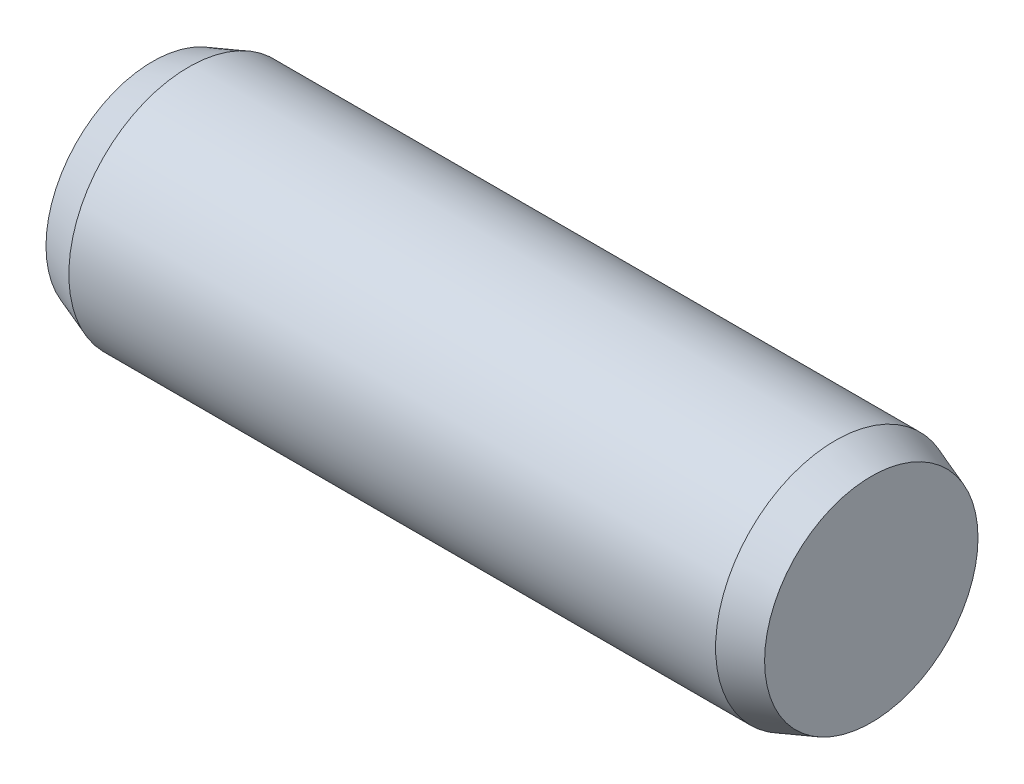
ISO-10303-21;
HEADER;
FILE_DESCRIPTION(('STEP AP214'),'2;1');
FILE_NAME('part.step','',(''),(''),'','','');
FILE_SCHEMA(('AUTOMOTIVE_DESIGN { 1 0 10303 214 1 1 1 1 }'));
ENDSEC;
DATA;
#1=APPLICATION_CONTEXT('core data for automotive mechanical design processes');
#2=APPLICATION_PROTOCOL_DEFINITION('international standard','automotive_design',2000,#1);
#3=PRODUCT_CONTEXT('',#1,'mechanical');
#4=PRODUCT('Part','Part','',(#3));
#5=PRODUCT_RELATED_PRODUCT_CATEGORY('part','',(#4));
#6=PRODUCT_DEFINITION_FORMATION('','',#4);
#7=PRODUCT_DEFINITION_CONTEXT('part definition',#1,'design');
#8=PRODUCT_DEFINITION('design','',#6,#7);
#9=PRODUCT_DEFINITION_SHAPE('','',#8);
#10=(LENGTH_UNIT() NAMED_UNIT(*) SI_UNIT(.MILLI.,.METRE.));
#11=(NAMED_UNIT(*) PLANE_ANGLE_UNIT() SI_UNIT($,.RADIAN.));
#12=(NAMED_UNIT(*) SI_UNIT($,.STERADIAN.) SOLID_ANGLE_UNIT());
#13=UNCERTAINTY_MEASURE_WITH_UNIT(LENGTH_MEASURE(1.E-05),#10,'distance_accuracy_value','');
#14=(GEOMETRIC_REPRESENTATION_CONTEXT(3) GLOBAL_UNCERTAINTY_ASSIGNED_CONTEXT((#13)) GLOBAL_UNIT_ASSIGNED_CONTEXT((#10,
#11,#12)) REPRESENTATION_CONTEXT('',''));
#15=CARTESIAN_POINT('',(0.,0.,0.));
#16=DIRECTION('',(0.,0.,1.));
#17=DIRECTION('',(1.,0.,0.));
#18=AXIS2_PLACEMENT_3D('',#15,#16,#17);
#19=CARTESIAN_POINT('',(-2.7,0.,0.));
#20=DIRECTION('',(1.,0.,0.));
#21=DIRECTION('',(0.,0.,-1.));
#22=AXIS2_PLACEMENT_3D('',#19,#20,#21);
#23=CONICAL_SURFACE('',#22,1.00009999999269,0.349065850338585);
#24=CARTESIAN_POINT('',(-3.,0.,0.));
#25=DIRECTION('',(1.,0.,0.));
#26=DIRECTION('',(0.,0.,-1.));
#27=AXIS2_PLACEMENT_3D('',#24,#25,#26);
#28=CIRCLE('',#27,0.890908929733314);
#29=CARTESIAN_POINT('',(-3.,0.,-0.890908929733314));
#30=VERTEX_POINT('',#29);
#31=EDGE_CURVE('E10',#30,#30,#28,.T.);
#32=ORIENTED_EDGE('',*,*,#31,.T.);
#33=EDGE_LOOP('',(#32));
#34=FACE_BOUND('',#33,.T.);
#35=CARTESIAN_POINT('',(-2.7,0.,0.));
#36=DIRECTION('',(1.,0.,0.));
#37=DIRECTION('',(0.,0.,-1.));
#38=AXIS2_PLACEMENT_3D('',#35,#36,#37);
#39=CIRCLE('',#38,1.00009999999269);
#40=CARTESIAN_POINT('',(-2.7,0.,-1.00009999999269));
#41=VERTEX_POINT('',#40);
#42=EDGE_CURVE('E45',#41,#41,#39,.T.);
#43=ORIENTED_EDGE('',*,*,#42,.F.);
#44=EDGE_LOOP('',(#43));
#45=FACE_BOUND('',#44,.T.);
#46=ADVANCED_FACE('F31',(#34,#45),#23,.T.);
#47=CARTESIAN_POINT('',(-3.,0.890908929733314,0.));
#48=DIRECTION('',(-1.,0.,0.));
#49=DIRECTION('',(0.,0.,1.));
#50=AXIS2_PLACEMENT_3D('',#47,#48,#49);
#51=PLANE('',#50);
#52=ORIENTED_EDGE('',*,*,#31,.F.);
#53=EDGE_LOOP('',(#52));
#54=FACE_BOUND('',#53,.T.);
#55=ADVANCED_FACE('F55',(#54),#51,.T.);
#56=CARTESIAN_POINT('',(3.,0.,0.));
#57=DIRECTION('',(1.,0.,0.));
#58=DIRECTION('',(0.,0.,-1.));
#59=AXIS2_PLACEMENT_3D('',#56,#57,#58);
#60=PLANE('',#59);
#61=CARTESIAN_POINT('',(3.,0.,0.));
#62=DIRECTION('',(1.,0.,0.));
#63=DIRECTION('',(0.,0.,-1.));
#64=AXIS2_PLACEMENT_3D('',#61,#62,#63);
#65=CIRCLE('',#64,0.890908929710118);
#66=CARTESIAN_POINT('',(3.,0.,-0.890908929710118));
#67=VERTEX_POINT('',#66);
#68=EDGE_CURVE('E37',#67,#67,#65,.T.);
#69=ORIENTED_EDGE('',*,*,#68,.T.);
#70=EDGE_LOOP('',(#69));
#71=FACE_BOUND('',#70,.T.);
#72=ADVANCED_FACE('F59',(#71),#60,.T.);
#73=CARTESIAN_POINT('',(3.,0.,0.));
#74=DIRECTION('',(-1.,0.,0.));
#75=DIRECTION('',(0.,0.,1.));
#76=AXIS2_PLACEMENT_3D('',#73,#74,#75);
#77=CONICAL_SURFACE('',#76,0.890908929710118,0.349065850406863);
#78=CARTESIAN_POINT('',(2.7,0.,0.));
#79=DIRECTION('',(1.,0.,0.));
#80=DIRECTION('',(0.,0.,-1.));
#81=AXIS2_PLACEMENT_3D('',#78,#79,#80);
#82=CIRCLE('',#81,1.0000999999927);
#83=CARTESIAN_POINT('',(2.7,0.,-1.0000999999927));
#84=VERTEX_POINT('',#83);
#85=EDGE_CURVE('E41',#84,#84,#82,.T.);
#86=ORIENTED_EDGE('',*,*,#85,.T.);
#87=EDGE_LOOP('',(#86));
#88=FACE_BOUND('',#87,.T.);
#89=ORIENTED_EDGE('',*,*,#68,.F.);
#90=EDGE_LOOP('',(#89));
#91=FACE_BOUND('',#90,.T.);
#92=ADVANCED_FACE('F64',(#88,#91),#77,.T.);
#93=CARTESIAN_POINT('',(-3.,0.,0.));
#94=DIRECTION('',(1.,0.,0.));
#95=DIRECTION('',(0.,0.,-1.));
#96=AXIS2_PLACEMENT_3D('',#93,#94,#95);
#97=CYLINDRICAL_SURFACE('',#96,1.00009999999269);
#98=ORIENTED_EDGE('',*,*,#42,.T.);
#99=EDGE_LOOP('',(#98));
#100=FACE_BOUND('',#99,.T.);
#101=ORIENTED_EDGE('',*,*,#85,.F.);
#102=EDGE_LOOP('',(#101));
#103=FACE_BOUND('',#102,.T.);
#104=ADVANCED_FACE('F51',(#100,#103),#97,.T.);
#105=CLOSED_SHELL('',(#46,#55,#72,#92,#104));
#106=MANIFOLD_SOLID_BREP('B2',#105);
#107=ADVANCED_BREP_SHAPE_REPRESENTATION('',(#18,#106),#14);
#108=SHAPE_DEFINITION_REPRESENTATION(#9,#107);
ENDSEC;
END-ISO-10303-21;
